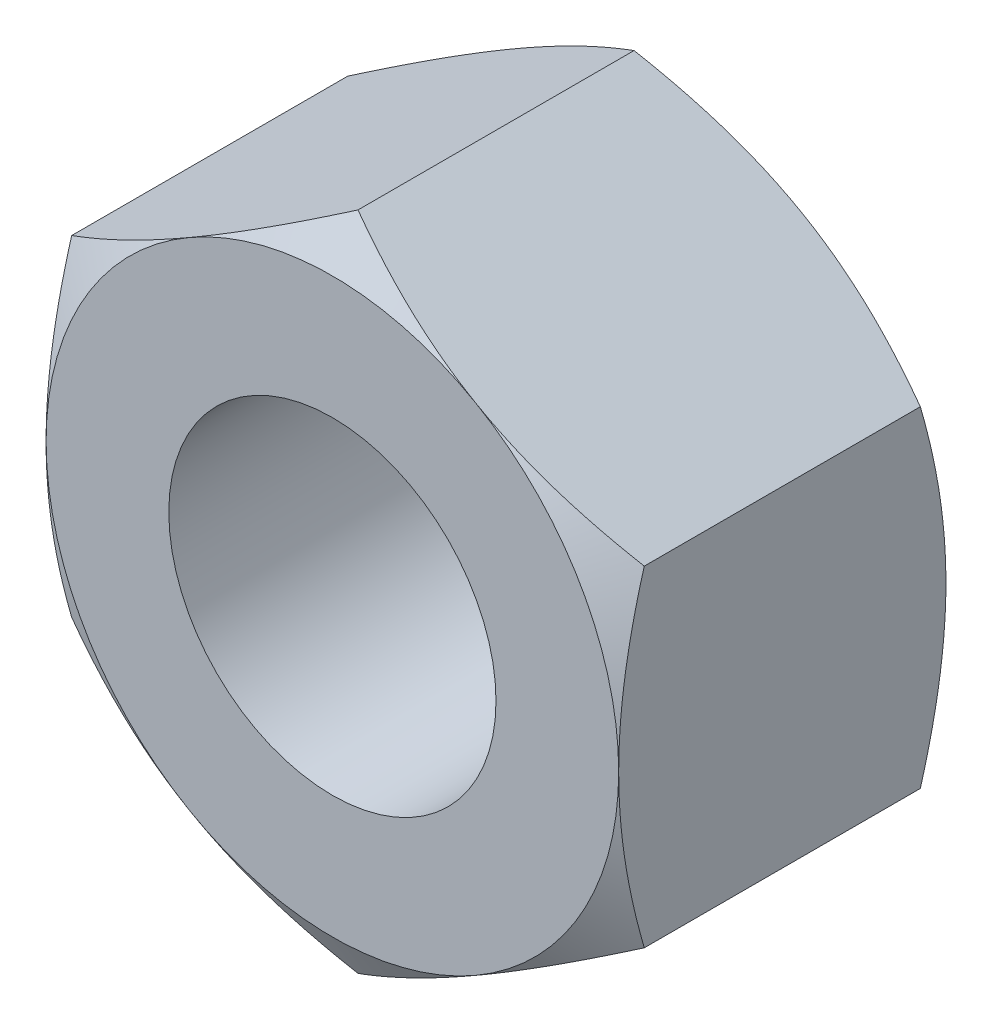
ISO-10303-21;
HEADER;
FILE_DESCRIPTION(('STEP AP214'),'2;1');
FILE_NAME('part.step','',(''),(''),'','','');
FILE_SCHEMA(('AUTOMOTIVE_DESIGN { 1 0 10303 214 1 1 1 1 }'));
ENDSEC;
DATA;
#1=APPLICATION_CONTEXT('core data for automotive mechanical design processes');
#2=APPLICATION_PROTOCOL_DEFINITION('international standard','automotive_design',2000,#1);
#3=PRODUCT_CONTEXT('',#1,'mechanical');
#4=PRODUCT('Part','Part','',(#3));
#5=PRODUCT_RELATED_PRODUCT_CATEGORY('part','',(#4));
#6=PRODUCT_DEFINITION_FORMATION('','',#4);
#7=PRODUCT_DEFINITION_CONTEXT('part definition',#1,'design');
#8=PRODUCT_DEFINITION('design','',#6,#7);
#9=PRODUCT_DEFINITION_SHAPE('','',#8);
#10=(LENGTH_UNIT() NAMED_UNIT(*) SI_UNIT(.MILLI.,.METRE.));
#11=(NAMED_UNIT(*) PLANE_ANGLE_UNIT() SI_UNIT($,.RADIAN.));
#12=(NAMED_UNIT(*) SI_UNIT($,.STERADIAN.) SOLID_ANGLE_UNIT());
#13=UNCERTAINTY_MEASURE_WITH_UNIT(LENGTH_MEASURE(1.E-05),#10,'distance_accuracy_value','');
#14=(GEOMETRIC_REPRESENTATION_CONTEXT(3) GLOBAL_UNCERTAINTY_ASSIGNED_CONTEXT((#13)) GLOBAL_UNIT_ASSIGNED_CONTEXT((#10,
#11,#12)) REPRESENTATION_CONTEXT('',''));
#15=CARTESIAN_POINT('',(0.,0.,0.));
#16=DIRECTION('',(0.,0.,1.));
#17=DIRECTION('',(1.,0.,0.));
#18=AXIS2_PLACEMENT_3D('',#15,#16,#17);
#19=CARTESIAN_POINT('',(0.,0.,4.));
#20=DIRECTION('',(0.,0.,1.));
#21=DIRECTION('',(1.,0.,0.));
#22=AXIS2_PLACEMENT_3D('',#19,#20,#21);
#23=PLANE('',#22);
#24=CARTESIAN_POINT('',(0.,0.,4.));
#25=DIRECTION('',(0.,0.,1.));
#26=DIRECTION('',(1.,0.,0.));
#27=AXIS2_PLACEMENT_3D('',#24,#25,#26);
#28=CIRCLE('',#27,3.49999999999999);
#29=CARTESIAN_POINT('',(3.5,0.,4.));
#30=VERTEX_POINT('',#29);
#31=CARTESIAN_POINT('',(1.75000000000001,-3.03108891324553,4.));
#32=VERTEX_POINT('',#31);
#33=EDGE_CURVE('E11',#30,#32,#28,.F.);
#34=ORIENTED_EDGE('',*,*,#33,.F.);
#35=CARTESIAN_POINT('',(1.75000000000001,3.03108891324553,4.));
#36=VERTEX_POINT('',#35);
#37=EDGE_CURVE('E38',#36,#30,#28,.F.);
#38=ORIENTED_EDGE('',*,*,#37,.F.);
#39=CARTESIAN_POINT('',(-1.74999999999999,3.03108891324554,4.));
#40=VERTEX_POINT('',#39);
#41=EDGE_CURVE('E277',#40,#36,#28,.F.);
#42=ORIENTED_EDGE('',*,*,#41,.F.);
#43=CARTESIAN_POINT('',(-3.5,0.,4.));
#44=VERTEX_POINT('',#43);
#45=EDGE_CURVE('E281',#44,#40,#28,.F.);
#46=ORIENTED_EDGE('',*,*,#45,.F.);
#47=CARTESIAN_POINT('',(-1.74999999999999,-3.03108891324554,4.));
#48=VERTEX_POINT('',#47);
#49=EDGE_CURVE('E305',#48,#44,#28,.F.);
#50=ORIENTED_EDGE('',*,*,#49,.F.);
#51=EDGE_CURVE('E43',#32,#48,#28,.F.);
#52=ORIENTED_EDGE('',*,*,#51,.F.);
#53=EDGE_LOOP('',(#34,#38,#42,#46,#50,#52));
#54=FACE_BOUND('',#53,.T.);
#55=CARTESIAN_POINT('',(0.,0.,4.));
#56=DIRECTION('',(0.,0.,1.));
#57=DIRECTION('',(1.,0.,0.));
#58=AXIS2_PLACEMENT_3D('',#55,#56,#57);
#59=CIRCLE('',#58,2.);
#60=CARTESIAN_POINT('',(2.,0.,4.));
#61=VERTEX_POINT('',#60);
#62=EDGE_CURVE('E248',#61,#61,#59,.T.);
#63=ORIENTED_EDGE('',*,*,#62,.F.);
#64=EDGE_LOOP('',(#63));
#65=FACE_BOUND('',#64,.T.);
#66=ADVANCED_FACE('F33',(#54,#65),#23,.T.);
#67=CARTESIAN_POINT('',(0.,0.,0.));
#68=DIRECTION('',(0.,0.,1.));
#69=DIRECTION('',(1.,0.,0.));
#70=AXIS2_PLACEMENT_3D('',#67,#68,#69);
#71=PLANE('',#70);
#72=CARTESIAN_POINT('',(0.,0.,0.));
#73=DIRECTION('',(0.,0.,1.));
#74=DIRECTION('',(1.,0.,0.));
#75=AXIS2_PLACEMENT_3D('',#72,#73,#74);
#76=CIRCLE('',#75,2.);
#77=CARTESIAN_POINT('',(2.,0.,0.));
#78=VERTEX_POINT('',#77);
#79=EDGE_CURVE('E251',#78,#78,#76,.F.);
#80=ORIENTED_EDGE('',*,*,#79,.F.);
#81=EDGE_LOOP('',(#80));
#82=FACE_BOUND('',#81,.T.);
#83=CARTESIAN_POINT('',(0.,0.,0.));
#84=DIRECTION('',(0.,0.,1.));
#85=DIRECTION('',(1.,0.,0.));
#86=AXIS2_PLACEMENT_3D('',#83,#84,#85);
#87=CIRCLE('',#86,3.49999999999999);
#88=CARTESIAN_POINT('',(1.75,3.03108891324553,0.));
#89=VERTEX_POINT('',#88);
#90=CARTESIAN_POINT('',(3.5,0.,0.));
#91=VERTEX_POINT('',#90);
#92=EDGE_CURVE('E142',#89,#91,#87,.F.);
#93=ORIENTED_EDGE('',*,*,#92,.T.);
#94=CARTESIAN_POINT('',(1.75,-3.03108891324553,0.));
#95=VERTEX_POINT('',#94);
#96=EDGE_CURVE('E150',#91,#95,#87,.F.);
#97=ORIENTED_EDGE('',*,*,#96,.T.);
#98=CARTESIAN_POINT('',(-1.75,-3.03108891324554,0.));
#99=VERTEX_POINT('',#98);
#100=EDGE_CURVE('E288',#95,#99,#87,.F.);
#101=ORIENTED_EDGE('',*,*,#100,.T.);
#102=CARTESIAN_POINT('',(-3.5,0.,0.));
#103=VERTEX_POINT('',#102);
#104=EDGE_CURVE('E291',#99,#103,#87,.F.);
#105=ORIENTED_EDGE('',*,*,#104,.T.);
#106=CARTESIAN_POINT('',(-1.75,3.03108891324554,0.));
#107=VERTEX_POINT('',#106);
#108=EDGE_CURVE('E154',#103,#107,#87,.F.);
#109=ORIENTED_EDGE('',*,*,#108,.T.);
#110=EDGE_CURVE('E128',#107,#89,#87,.F.);
#111=ORIENTED_EDGE('',*,*,#110,.T.);
#112=EDGE_LOOP('',(#93,#97,#101,#105,#109,#111));
#113=FACE_BOUND('',#112,.T.);
#114=ADVANCED_FACE('F151',(#82,#113),#71,.F.);
#115=CARTESIAN_POINT('',(0.,0.,-0.00100000000000013));
#116=DIRECTION('',(0.,0.,1.));
#117=DIRECTION('',(1.,0.,0.));
#118=AXIS2_PLACEMENT_3D('',#115,#116,#117);
#119=CYLINDRICAL_SURFACE('',#118,2.);
#120=ORIENTED_EDGE('',*,*,#62,.T.);
#121=EDGE_LOOP('',(#120));
#122=FACE_BOUND('',#121,.T.);
#123=ORIENTED_EDGE('',*,*,#79,.T.);
#124=EDGE_LOOP('',(#123));
#125=FACE_BOUND('',#124,.T.);
#126=ADVANCED_FACE('F333',(#122,#125),#119,.F.);
#127=CARTESIAN_POINT('',(0.,0.,1.99999999999999));
#128=DIRECTION('',(0.,0.,1.));
#129=DIRECTION('',(1.,0.,0.));
#130=AXIS2_PLACEMENT_3D('',#127,#128,#129);
#131=CONICAL_SURFACE('',#130,6.96410161513779,1.0471975511966);
#132=CARTESIAN_POINT('',(3.5,-5.45519430990487,1.72133877128074));
#133=CARTESIAN_POINT('',(3.5,-5.30207410531419,1.64695247526558));
#134=CARTESIAN_POINT('',(3.5,-5.14860527468032,1.5732716581178));
#135=CARTESIAN_POINT('',(3.5,-4.84078502728516,1.42771728825662));
#136=CARTESIAN_POINT('',(3.5,-4.68643347840116,1.35584401526786));
#137=CARTESIAN_POINT('',(3.5,-4.37588046871568,1.21394538752446));
#138=CARTESIAN_POINT('',(3.5,-4.21967352819375,1.1439319845114));
#139=CARTESIAN_POINT('',(3.5,-3.90602649209171,1.00673479979934));
#140=CARTESIAN_POINT('',(3.5,-3.74858645444087,0.939550886109097));
#141=CARTESIAN_POINT('',(3.5,-3.42708117765558,0.806633263191025));
#142=CARTESIAN_POINT('',(3.5,-3.26296687658298,0.741017585836152));
#143=CARTESIAN_POINT('',(3.5,-2.93282845135114,0.614686563150204));
#144=CARTESIAN_POINT('',(3.5,-2.76680411677797,0.553971763733598));
#145=CARTESIAN_POINT('',(3.5,-2.43288333087243,0.439016058702318));
#146=CARTESIAN_POINT('',(3.5,-2.2649913515245,0.38476229206775));
#147=CARTESIAN_POINT('',(3.5,-1.92679932486831,0.284451348590473));
#148=CARTESIAN_POINT('',(3.5,-1.75650004516851,0.238391619862058));
#149=CARTESIAN_POINT('',(3.5,-1.41432463666518,0.156901852467947));
#150=CARTESIAN_POINT('',(3.5,-1.24246240218227,0.121414538366513));
#151=CARTESIAN_POINT('',(3.5,-0.896572668283585,0.06306428383971));
#152=CARTESIAN_POINT('',(3.5,-0.722545390875949,0.0402000597498763));
#153=CARTESIAN_POINT('',(3.5,-0.375480083540643,0.00921812370481169));
#154=CARTESIAN_POINT('',(3.5,-0.20245960885449,0.000908605400914017));
#155=CARTESIAN_POINT('',(3.5,0.143670103831307,-0.000766076343882342));
#156=CARTESIAN_POINT('',(3.5,0.316779343751389,0.00586909847148927));
#157=CARTESIAN_POINT('',(3.5,0.609822561539331,0.0292790458924698));
#158=CARTESIAN_POINT('',(3.5,0.730066998486727,0.0423974842578047));
#159=CARTESIAN_POINT('',(3.5,0.969688542331738,0.0750434688864105));
#160=CARTESIAN_POINT('',(3.5,1.08906553264177,0.0945718609580701));
#161=CARTESIAN_POINT('',(3.5,1.44572590552468,0.161746861486087));
#162=CARTESIAN_POINT('',(3.5,1.68141230395974,0.217971844846831));
#163=CARTESIAN_POINT('',(3.5,2.03394340877959,0.315650082359494));
#164=CARTESIAN_POINT('',(3.5,2.15260940955841,0.350905657418922));
#165=CARTESIAN_POINT('',(3.5,2.3887886032686,0.42512091040231));
#166=CARTESIAN_POINT('',(3.5,2.5063017878082,0.464080615267938));
#167=CARTESIAN_POINT('',(3.5,2.74021290999465,0.545075266876938));
#168=CARTESIAN_POINT('',(3.5,2.85661118217145,0.587109256264606));
#169=CARTESIAN_POINT('',(3.5,3.08843931242516,0.673753617516125));
#170=CARTESIAN_POINT('',(3.5,3.20386918866012,0.718363940947816));
#171=CARTESIAN_POINT('',(3.5,3.50212684846259,0.836846816328761));
#172=CARTESIAN_POINT('',(3.5,3.68429688398129,0.912373157370813));
#173=CARTESIAN_POINT('',(3.5,4.04687596102653,1.0675544669986));
#174=CARTESIAN_POINT('',(3.5,4.22728483993995,1.14720981262281));
#175=CARTESIAN_POINT('',(3.5,4.586717894845,1.30971359246563));
#176=CARTESIAN_POINT('',(3.5,4.76574165040922,1.39256295377734));
#177=CARTESIAN_POINT('',(3.5,5.1226235548627,1.5607395401122));
#178=CARTESIAN_POINT('',(3.5,5.30048167200969,1.6460668322727));
#179=CARTESIAN_POINT('',(3.5,5.8331287111142,1.90519383502204));
#180=CARTESIAN_POINT('',(3.5,6.18649646052233,2.08191163241848));
#181=CARTESIAN_POINT('',(3.5,6.8905998674985,2.44032821615532));
#182=CARTESIAN_POINT('',(3.5,7.24133597495097,2.62202612522926));
#183=CARTESIAN_POINT('',(3.5,7.90653300532992,2.97079615200147));
#184=CARTESIAN_POINT('',(3.5,8.22116341317776,3.13754558570907));
#185=CARTESIAN_POINT('',(3.5,8.84934047800308,3.47310878648261));
#186=CARTESIAN_POINT('',(3.5,9.162887078266,3.64192265954216));
#187=CARTESIAN_POINT('',(3.5,9.78819651869821,3.98058089771805));
#188=CARTESIAN_POINT('',(3.5,10.0999618857039,4.15042060283278));
#189=CARTESIAN_POINT('',(3.5,10.7228127904779,4.49129148686705));
#190=CARTESIAN_POINT('',(3.5,11.0338983738492,4.66232258242458));
#191=CARTESIAN_POINT('',(3.5,11.3447416308959,4.8337899092484));
#192=B_SPLINE_CURVE_WITH_KNOTS('',3,(#132,#133,#134,#135,#136,#137,#138,#139,#140,#141,#142,
#143,#144,#145,#146,#147,#148,#149,#150,#151,#152,#153,#154,#155,#156,#157,#158,#159,#160,#161,
#162,#163,#164,#165,#166,#167,#168,#169,#170,#171,#172,#173,#174,#175,#176,#177,#178,#179,#180,
#181,#182,#183,#184,#185,#186,#187,#188,#189,#190,#191),.UNSPECIFIED.,.F.,.F.,(4,2,2,2,2,2,2,2,
2,2,2,2,2,2,2,2,2,2,2,2,2,2,2,2,2,2,2,2,2,4),(0.,0.51070373683401,1.02148602673776,
1.53500259956243,2.04849519105291,2.57867074927619,3.10890528310494,3.63806606190065,
4.16706175349099,4.69313723180645,5.21915920271268,5.73819541711383,6.25724337943225,
6.61994180397091,6.98268810666761,7.70855969207668,8.07990492899787,8.45125286707322,
8.82248565293817,9.19371146231784,9.78525513285665,10.3768529154637,10.9686237272046,
11.5604105874407,12.7456145372053,13.930611033641,14.9988604186191,16.0671648824704,
17.1322387611645,18.1972388502145),.UNSPECIFIED.);
#193=CARTESIAN_POINT('',(3.5,2.02072594216369,0.312607391169638));
#194=VERTEX_POINT('',#193);
#195=EDGE_CURVE('E145',#91,#194,#192,.T.);
#196=ORIENTED_EDGE('',*,*,#195,.F.);
#197=ORIENTED_EDGE('',*,*,#92,.F.);
#198=CARTESIAN_POINT('',(3.5002,2.02061047210985,0.312674060693366));
#199=CARTESIAN_POINT('',(3.34639282154755,2.10941108799267,0.261385788989979));
#200=CARTESIAN_POINT('',(3.19125798916558,2.19897822522909,0.214740953816194));
#201=CARTESIAN_POINT('',(2.87830199342322,2.37966345361545,0.133321875533347));
#202=CARTESIAN_POINT('',(2.7204752692125,2.47078475532382,0.0985764355845609));
#203=CARTESIAN_POINT('',(2.40677778961987,2.65189807961074,0.0444900271828373));
#204=CARTESIAN_POINT('',(2.25095530083931,2.74186223545399,0.0247890862603835));
#205=CARTESIAN_POINT('',(1.93857711279463,2.92221386641056,0.00127013273725678));
#206=CARTESIAN_POINT('',(1.78202254896577,3.01260068598001,-0.00256735545443255));
#207=CARTESIAN_POINT('',(1.48949078007901,3.1814939814933,0.00541530187698004));
#208=CARTESIAN_POINT('',(1.35346978754209,3.26002573814993,0.0152754340696098));
#209=CARTESIAN_POINT('',(1.08231397971101,3.41657761679354,0.0465264668994058));
#210=CARTESIAN_POINT('',(0.947180102315317,3.49459719728458,0.0679280432857999));
#211=CARTESIAN_POINT('',(0.675465207594816,3.65147186489429,0.121430407880578));
#212=CARTESIAN_POINT('',(0.538918580721665,3.73030709667644,0.153757994445088));
#213=CARTESIAN_POINT('',(0.267861907055499,3.88680174018324,0.227128933807995));
#214=CARTESIAN_POINT('',(0.133348387531464,3.96446315689009,0.268155046569867));
#215=CARTESIAN_POINT('',(-0.000199999999999596,4.04156735438122,0.31267406069337));
#216=B_SPLINE_CURVE_WITH_KNOTS('',3,(#198,#199,#200,#201,#202,#203,#204,#205,#206,#207,#208,
#209,#210,#211,#212,#213,#214,#215),.UNSPECIFIED.,.F.,.F.,(4,2,2,2,2,2,2,2,4),(0.,
0.554793832886253,1.11092123814984,1.65328467083219,2.19498204478403,2.6666513085086,
3.13875761298267,3.62133612600509,4.10296698719187),.UNSPECIFIED.);
#217=EDGE_CURVE('E138',#194,#89,#216,.T.);
#218=ORIENTED_EDGE('',*,*,#217,.F.);
#219=EDGE_LOOP('',(#196,#197,#218));
#220=FACE_BOUND('',#219,.T.);
#221=ADVANCED_FACE('F143',(#220),#131,.T.);
#222=CARTESIAN_POINT('',(0.,4.04145188432738,0.312607391169642));
#223=VERTEX_POINT('',#222);
#224=EDGE_CURVE('E124',#89,#223,#216,.T.);
#225=ORIENTED_EDGE('',*,*,#224,.F.);
#226=ORIENTED_EDGE('',*,*,#110,.F.);
#227=CARTESIAN_POINT('',(0.000200000000000381,4.04156735438122,0.31267406069337));
#228=CARTESIAN_POINT('',(-0.153607178452449,3.9527667384984,0.261385788989983));
#229=CARTESIAN_POINT('',(-0.308742010834423,3.86319960126198,0.214740953816198));
#230=CARTESIAN_POINT('',(-0.62169800657678,3.68251437287562,0.133321875533351));
#231=CARTESIAN_POINT('',(-0.779524730787495,3.59139307116725,0.0985764355845644));
#232=CARTESIAN_POINT('',(-1.09322221038013,3.41027974688034,0.0444900271828402));
#233=CARTESIAN_POINT('',(-1.24904469916069,3.32031559103708,0.0247890862603861));
#234=CARTESIAN_POINT('',(-1.56142288720537,3.13996396008052,0.00127013273725943));
#235=CARTESIAN_POINT('',(-1.71797745103423,3.04957714051106,-0.00256735545442963));
#236=CARTESIAN_POINT('',(-2.01050921992099,2.88068384499778,0.00541530187698267));
#237=CARTESIAN_POINT('',(-2.1465302124579,2.80215208834115,0.015275434069612));
#238=CARTESIAN_POINT('',(-2.41768602028899,2.64560020969754,0.0465264668994078));
#239=CARTESIAN_POINT('',(-2.55281989768468,2.5675806292065,0.067928043285802));
#240=CARTESIAN_POINT('',(-2.82453479240518,2.41070596159679,0.12143040788058));
#241=CARTESIAN_POINT('',(-2.96108141927834,2.33187072981464,0.15375799444509));
#242=CARTESIAN_POINT('',(-3.2321380929445,2.17537608630783,0.227128933807997));
#243=CARTESIAN_POINT('',(-3.36665161246854,2.09771466960099,0.268155046569869));
#244=CARTESIAN_POINT('',(-3.5002,2.02061047210985,0.312674060693373));
#245=B_SPLINE_CURVE_WITH_KNOTS('',3,(#227,#228,#229,#230,#231,#232,#233,#234,#235,#236,#237,
#238,#239,#240,#241,#242,#243,#244),.UNSPECIFIED.,.F.,.F.,(4,2,2,2,2,2,2,2,4),(0.,
0.554793832886252,1.11092123814983,1.65328467083218,2.19498204478403,2.6666513085086,
3.13875761298267,3.62133612600509,4.10296698719187),.UNSPECIFIED.);
#246=EDGE_CURVE('E131',#223,#107,#245,.T.);
#247=ORIENTED_EDGE('',*,*,#246,.F.);
#248=EDGE_LOOP('',(#225,#226,#247));
#249=FACE_BOUND('',#248,.T.);
#250=ADVANCED_FACE('F126',(#249),#131,.T.);
#251=CARTESIAN_POINT('',(-3.5,2.02072594216369,0.312607391169645));
#252=VERTEX_POINT('',#251);
#253=EDGE_CURVE('E204',#107,#252,#245,.T.);
#254=ORIENTED_EDGE('',*,*,#253,.F.);
#255=ORIENTED_EDGE('',*,*,#108,.F.);
#256=CARTESIAN_POINT('',(-3.5,-5.45519430990485,1.72133877128074));
#257=CARTESIAN_POINT('',(-3.5,-5.30207410531418,1.64695247526558));
#258=CARTESIAN_POINT('',(-3.5,-5.14860527468031,1.5732716581178));
#259=CARTESIAN_POINT('',(-3.5,-4.84078502728515,1.42771728825662));
#260=CARTESIAN_POINT('',(-3.5,-4.68643347840115,1.35584401526786));
#261=CARTESIAN_POINT('',(-3.5,-4.37588046871567,1.21394538752447));
#262=CARTESIAN_POINT('',(-3.5,-4.21967352819374,1.14393198451141));
#263=CARTESIAN_POINT('',(-3.5,-3.9060264920917,1.00673479979934));
#264=CARTESIAN_POINT('',(-3.5,-3.74858645444087,0.939550886109103));
#265=CARTESIAN_POINT('',(-3.5,-3.42708117765557,0.806633263191031));
#266=CARTESIAN_POINT('',(-3.5,-3.26296687658297,0.741017585836158));
#267=CARTESIAN_POINT('',(-3.5,-2.93282845135114,0.61468656315021));
#268=CARTESIAN_POINT('',(-3.5,-2.76680411677796,0.553971763733604));
#269=CARTESIAN_POINT('',(-3.5,-2.43288333087243,0.439016058702324));
#270=CARTESIAN_POINT('',(-3.5,-2.2649913515245,0.384762292067755));
#271=CARTESIAN_POINT('',(-3.5,-1.92679932486831,0.284451348590478));
#272=CARTESIAN_POINT('',(-3.5,-1.7565000451685,0.238391619862064));
#273=CARTESIAN_POINT('',(-3.5,-1.41432463666518,0.156901852467953));
#274=CARTESIAN_POINT('',(-3.5,-1.24246240218227,0.121414538366519));
#275=CARTESIAN_POINT('',(-3.5,-0.896572668283585,0.0630642838397154));
#276=CARTESIAN_POINT('',(-3.5,-0.722545390875949,0.0402000597498815));
#277=CARTESIAN_POINT('',(-3.5,-0.375480083540644,0.00921812370481673));
#278=CARTESIAN_POINT('',(-3.5,-0.202459608854491,0.000908605400919081));
#279=CARTESIAN_POINT('',(-3.5,0.143670103831305,-0.000766076343877335));
#280=CARTESIAN_POINT('',(-3.5,0.316779343751386,0.00586909847149419));
#281=CARTESIAN_POINT('',(-3.5,0.609822561539328,0.0292790458924746));
#282=CARTESIAN_POINT('',(-3.5,0.730066998486723,0.0423974842578094));
#283=CARTESIAN_POINT('',(-3.5,0.969688542331733,0.0750434688864149));
#284=CARTESIAN_POINT('',(-3.5,1.08906553264177,0.0945718609580743));
#285=CARTESIAN_POINT('',(-3.5,1.44572590552467,0.161746861486091));
#286=CARTESIAN_POINT('',(-3.5,1.68141230395973,0.217971844846835));
#287=CARTESIAN_POINT('',(-3.5,2.03394340877957,0.315650082359497));
#288=CARTESIAN_POINT('',(-3.5,2.1526094095584,0.350905657418925));
#289=CARTESIAN_POINT('',(-3.5,2.38878860326859,0.425120910402313));
#290=CARTESIAN_POINT('',(-3.5,2.50630178780818,0.46408061526794));
#291=CARTESIAN_POINT('',(-3.5,2.74021290999463,0.54507526687694));
#292=CARTESIAN_POINT('',(-3.5,2.85661118217144,0.587109256264607));
#293=CARTESIAN_POINT('',(-3.5,3.08843931242514,0.673753617516126));
#294=CARTESIAN_POINT('',(-3.5,3.2038691886601,0.718363940947817));
#295=CARTESIAN_POINT('',(-3.5,3.50212684846257,0.836846816328762));
#296=CARTESIAN_POINT('',(-3.5,3.68429688398127,0.912373157370814));
#297=CARTESIAN_POINT('',(-3.5,4.04687596102651,1.0675544669986));
#298=CARTESIAN_POINT('',(-3.5,4.22728483993993,1.14720981262281));
#299=CARTESIAN_POINT('',(-3.5,4.58671789484498,1.30971359246563));
#300=CARTESIAN_POINT('',(-3.5,4.7657416504092,1.39256295377734));
#301=CARTESIAN_POINT('',(-3.5,5.12262355486268,1.5607395401122));
#302=CARTESIAN_POINT('',(-3.5,5.30048167200967,1.6460668322727));
#303=CARTESIAN_POINT('',(-3.5,5.83312871111418,1.90519383502205));
#304=CARTESIAN_POINT('',(-3.5,6.18649646052231,2.08191163241848));
#305=CARTESIAN_POINT('',(-3.5,6.89059986749848,2.44032821615532));
#306=CARTESIAN_POINT('',(-3.5,7.24133597495096,2.62202612522926));
#307=CARTESIAN_POINT('',(-3.5,7.9065330053299,2.97079615200147));
#308=CARTESIAN_POINT('',(-3.5,8.22116341317775,3.13754558570908));
#309=CARTESIAN_POINT('',(-3.5,8.84934047800306,3.47310878648262));
#310=CARTESIAN_POINT('',(-3.5,9.16288707826598,3.64192265954217));
#311=CARTESIAN_POINT('',(-3.5,9.78819651869819,3.98058089771805));
#312=CARTESIAN_POINT('',(-3.5,10.0999618857039,4.15042060283278));
#313=CARTESIAN_POINT('',(-3.5,10.7228127904779,4.49129148686705));
#314=CARTESIAN_POINT('',(-3.5,11.0338983738491,4.66232258242458));
#315=CARTESIAN_POINT('',(-3.5,11.3447416308959,4.8337899092484));
#316=B_SPLINE_CURVE_WITH_KNOTS('',3,(#256,#257,#258,#259,#260,#261,#262,#263,#264,#265,#266,
#267,#268,#269,#270,#271,#272,#273,#274,#275,#276,#277,#278,#279,#280,#281,#282,#283,#284,#285,
#286,#287,#288,#289,#290,#291,#292,#293,#294,#295,#296,#297,#298,#299,#300,#301,#302,#303,#304,
#305,#306,#307,#308,#309,#310,#311,#312,#313,#314,#315),.UNSPECIFIED.,.F.,.F.,(4,2,2,2,2,2,2,2,
2,2,2,2,2,2,2,2,2,2,2,2,2,2,2,2,2,2,2,2,2,4),(0.,0.510703736834008,1.02148602673775,
1.53500259956242,2.0484951910529,2.57867074927618,3.10890528310493,3.63806606190064,
4.16706175349098,4.69313723180643,5.21915920271267,5.73819541711382,6.25724337943223,
6.61994180397089,6.98268810666759,7.70855969207665,8.07990492899784,8.45125286707319,
8.82248565293814,9.1937114623178,9.78525513285662,10.3768529154637,10.9686237272046,
11.5604105874406,12.7456145372052,13.930611033641,14.9988604186191,16.0671648824704,
17.1322387611644,18.1972388502144),.UNSPECIFIED.);
#317=EDGE_CURVE('E197',#252,#103,#316,.F.);
#318=ORIENTED_EDGE('',*,*,#317,.F.);
#319=EDGE_LOOP('',(#254,#255,#318));
#320=FACE_BOUND('',#319,.T.);
#321=ADVANCED_FACE('F300',(#320),#131,.T.);
#322=CARTESIAN_POINT('',(-3.5,-2.02072594216407,0.312607391169393));
#323=VERTEX_POINT('',#322);
#324=EDGE_CURVE('E203',#103,#323,#316,.F.);
#325=ORIENTED_EDGE('',*,*,#324,.F.);
#326=ORIENTED_EDGE('',*,*,#104,.F.);
#327=CARTESIAN_POINT('',(-3.5002,-2.02061047210985,0.312674060693372));
#328=CARTESIAN_POINT('',(-3.34639282154755,-2.10941108799267,0.261385788989985));
#329=CARTESIAN_POINT('',(-3.19125798916558,-2.19897822522909,0.2147409538162));
#330=CARTESIAN_POINT('',(-2.87830199342322,-2.37966345361545,0.133321875533352));
#331=CARTESIAN_POINT('',(-2.72047526921251,-2.47078475532382,0.0985764355845655));
#332=CARTESIAN_POINT('',(-2.40677778961988,-2.65189807961073,0.0444900271828406));
#333=CARTESIAN_POINT('',(-2.25095530083931,-2.74186223545399,0.0247890862603861));
#334=CARTESIAN_POINT('',(-1.93857711279463,-2.92221386641055,0.0012701327372587));
#335=CARTESIAN_POINT('',(-1.78202254896578,-3.01260068598001,-0.00256735545443074));
#336=CARTESIAN_POINT('',(-1.48949078007902,-3.18149398149329,0.00541530187698111));
#337=CARTESIAN_POINT('',(-1.3534697875421,-3.26002573814992,0.0152754340696103));
#338=CARTESIAN_POINT('',(-1.08231397971101,-3.41657761679353,0.0465264668994058));
#339=CARTESIAN_POINT('',(-0.947180102315321,-3.49459719728457,0.0679280432857997));
#340=CARTESIAN_POINT('',(-0.67546520759482,-3.65147186489428,0.121430407880578));
#341=CARTESIAN_POINT('',(-0.538918580721667,-3.73030709667643,0.153757994445087));
#342=CARTESIAN_POINT('',(-0.2678619070555,-3.88680174018324,0.227128933807994));
#343=CARTESIAN_POINT('',(-0.133348387531465,-3.96446315689009,0.268155046569866));
#344=CARTESIAN_POINT('',(0.000199999999999129,-4.04156735438122,0.312674060693369));
#345=B_SPLINE_CURVE_WITH_KNOTS('',3,(#327,#328,#329,#330,#331,#332,#333,#334,#335,#336,#337,
#338,#339,#340,#341,#342,#343,#344),.UNSPECIFIED.,.F.,.F.,(4,2,2,2,2,2,2,2,4),(0.,
0.554793832886252,1.11092123814983,1.65328467083218,2.19498204478402,2.66665130850859,
3.13875761298267,3.62133612600509,4.10296698719187),.UNSPECIFIED.);
#346=EDGE_CURVE('E205',#323,#99,#345,.T.);
#347=ORIENTED_EDGE('',*,*,#346,.F.);
#348=EDGE_LOOP('',(#325,#326,#347));
#349=FACE_BOUND('',#348,.T.);
#350=ADVANCED_FACE('F182',(#349),#131,.T.);
#351=CARTESIAN_POINT('',(0.,-4.04145188432738,0.312607391169641));
#352=VERTEX_POINT('',#351);
#353=EDGE_CURVE('E353',#99,#352,#345,.T.);
#354=ORIENTED_EDGE('',*,*,#353,.F.);
#355=ORIENTED_EDGE('',*,*,#100,.F.);
#356=CARTESIAN_POINT('',(-0.000200000000001019,-4.04156735438122,0.312674060693369));
#357=CARTESIAN_POINT('',(0.153607178452448,-3.9527667384984,0.261385788989982));
#358=CARTESIAN_POINT('',(0.308742010834423,-3.86319960126198,0.214740953816196));
#359=CARTESIAN_POINT('',(0.621698006576779,-3.68251437287562,0.133321875533349));
#360=CARTESIAN_POINT('',(0.779524730787494,-3.59139307116725,0.0985764355845624));
#361=CARTESIAN_POINT('',(1.09322221038012,-3.41027974688034,0.0444900271828378));
#362=CARTESIAN_POINT('',(1.24904469916069,-3.32031559103708,0.0247890862603835));
#363=CARTESIAN_POINT('',(1.56142288720537,-3.13996396008052,0.00127013273725603));
#364=CARTESIAN_POINT('',(1.71797745103423,-3.04957714051106,-0.00256735545443351));
#365=CARTESIAN_POINT('',(2.01050921992099,-2.88068384499778,0.00541530187697872));
#366=CARTESIAN_POINT('',(2.1465302124579,-2.80215208834115,0.0152754340696083));
#367=CARTESIAN_POINT('',(2.41768602028899,-2.64560020969754,0.046526466899404));
#368=CARTESIAN_POINT('',(2.55281989768468,-2.5675806292065,0.0679280432857976));
#369=CARTESIAN_POINT('',(2.82453479240518,-2.41070596159679,0.121430407880575));
#370=CARTESIAN_POINT('',(2.96108141927833,-2.33187072981464,0.153757994445085));
#371=CARTESIAN_POINT('',(3.2321380929445,-2.17537608630783,0.227128933807991));
#372=CARTESIAN_POINT('',(3.36665161246854,-2.09771466960099,0.268155046569863));
#373=CARTESIAN_POINT('',(3.5002,-2.02061047210985,0.312674060693366));
#374=B_SPLINE_CURVE_WITH_KNOTS('',3,(#356,#357,#358,#359,#360,#361,#362,#363,#364,#365,#366,
#367,#368,#369,#370,#371,#372,#373),.UNSPECIFIED.,.F.,.F.,(4,2,2,2,2,2,2,2,4),(0.,
0.554793832886252,1.11092123814983,1.65328467083218,2.19498204478403,2.6666513085086,
3.13875761298267,3.62133612600509,4.10296698719187),.UNSPECIFIED.);
#375=EDGE_CURVE('E163',#352,#95,#374,.T.);
#376=ORIENTED_EDGE('',*,*,#375,.F.);
#377=EDGE_LOOP('',(#354,#355,#376));
#378=FACE_BOUND('',#377,.T.);
#379=ADVANCED_FACE('F177',(#378),#131,.T.);
#380=CARTESIAN_POINT('',(3.5,-2.02072594216369,0.312607391169638));
#381=VERTEX_POINT('',#380);
#382=EDGE_CURVE('E159',#95,#381,#374,.T.);
#383=ORIENTED_EDGE('',*,*,#382,.F.);
#384=ORIENTED_EDGE('',*,*,#96,.F.);
#385=EDGE_CURVE('E136',#381,#91,#192,.T.);
#386=ORIENTED_EDGE('',*,*,#385,.F.);
#387=EDGE_LOOP('',(#383,#384,#386));
#388=FACE_BOUND('',#387,.T.);
#389=ADVANCED_FACE('F181',(#388),#131,.T.);
#390=CARTESIAN_POINT('',(0.,0.,5.));
#391=DIRECTION('',(0.,0.,-1.));
#392=DIRECTION('',(-1.,0.,0.));
#393=AXIS2_PLACEMENT_3D('',#390,#391,#392);
#394=CONICAL_SURFACE('',#393,1.7679491924311,1.0471975511966);
#395=CARTESIAN_POINT('',(-0.000199999999999687,4.04156735438122,3.68732593930663));
#396=CARTESIAN_POINT('',(0.15360717845245,3.9527667384984,3.73861421101001));
#397=CARTESIAN_POINT('',(0.308742010834424,3.86319960126198,3.7852590461838));
#398=CARTESIAN_POINT('',(0.621698006576782,3.68251437287562,3.86667812446665));
#399=CARTESIAN_POINT('',(0.779524730787496,3.59139307116725,3.90142356441543));
#400=CARTESIAN_POINT('',(1.09322221038013,3.41027974688034,3.95550997281716));
#401=CARTESIAN_POINT('',(1.24904469916069,3.32031559103708,3.97521091373961));
#402=CARTESIAN_POINT('',(1.56142288720537,3.13996396008052,3.99872986726274));
#403=CARTESIAN_POINT('',(1.71797745103423,3.04957714051106,4.00256735545443));
#404=CARTESIAN_POINT('',(2.01050921992099,2.88068384499777,3.99458469812301));
#405=CARTESIAN_POINT('',(2.14653021245791,2.80215208834114,3.98472456593038));
#406=CARTESIAN_POINT('',(2.417686020289,2.64560020969754,3.95347353310059));
#407=CARTESIAN_POINT('',(2.55281989768468,2.5675806292065,3.93207195671419));
#408=CARTESIAN_POINT('',(2.82453479240518,2.41070596159678,3.87856959211941));
#409=CARTESIAN_POINT('',(2.96108141927834,2.33187072981464,3.8462420055549));
#410=CARTESIAN_POINT('',(3.2321380929445,2.17537608630783,3.772871066192));
#411=CARTESIAN_POINT('',(3.36665161246854,2.09771466960098,3.73184495343012));
#412=CARTESIAN_POINT('',(3.5002,2.02061047210985,3.68732593930662));
#413=B_SPLINE_CURVE_WITH_KNOTS('',3,(#395,#396,#397,#398,#399,#400,#401,#402,#403,#404,#405,
#406,#407,#408,#409,#410,#411,#412),.UNSPECIFIED.,.F.,.F.,(4,2,2,2,2,2,2,2,4),(0.,
0.554793832886253,1.11092123814984,1.65328467083219,2.19498204478403,2.6666513085086,
3.13875761298267,3.6213361260051,4.10296698719187),.UNSPECIFIED.);
#414=CARTESIAN_POINT('',(3.5,2.02072594216369,3.68739260883035));
#415=VERTEX_POINT('',#414);
#416=EDGE_CURVE('E247',#36,#415,#413,.T.);
#417=ORIENTED_EDGE('',*,*,#416,.F.);
#418=ORIENTED_EDGE('',*,*,#37,.T.);
#419=CARTESIAN_POINT('',(3.5,-5.45519430990486,2.27866122871924));
#420=CARTESIAN_POINT('',(3.5,-5.30207410531418,2.35304752473439));
#421=CARTESIAN_POINT('',(3.5,-5.14860527468032,2.42672834188218));
#422=CARTESIAN_POINT('',(3.5,-4.84078502728515,2.57228271174336));
#423=CARTESIAN_POINT('',(3.5,-4.68643347840115,2.64415598473212));
#424=CARTESIAN_POINT('',(3.5,-4.37588046871568,2.78605461247552));
#425=CARTESIAN_POINT('',(3.5,-4.21967352819375,2.85606801548857));
#426=CARTESIAN_POINT('',(3.5,-3.90602649209171,2.99326520020064));
#427=CARTESIAN_POINT('',(3.5,-3.74858645444087,3.06044911389088));
#428=CARTESIAN_POINT('',(3.5,-3.42708117765558,3.19336673680896));
#429=CARTESIAN_POINT('',(3.5,-3.26296687658297,3.25898241416383));
#430=CARTESIAN_POINT('',(3.5,-2.93282845135114,3.38531343684978));
#431=CARTESIAN_POINT('',(3.5,-2.76680411677797,3.44602823626639));
#432=CARTESIAN_POINT('',(3.5,-2.43288333087243,3.56098394129767));
#433=CARTESIAN_POINT('',(3.5,-2.2649913515245,3.61523770793224));
#434=CARTESIAN_POINT('',(3.5,-1.92679932486831,3.71554865140951));
#435=CARTESIAN_POINT('',(3.5,-1.75650004516851,3.76160838013793));
#436=CARTESIAN_POINT('',(3.5,-1.41432463666518,3.84309814753204));
#437=CARTESIAN_POINT('',(3.5,-1.24246240218227,3.87858546163348));
#438=CARTESIAN_POINT('',(3.5,-0.896572668283583,3.93693571616028));
#439=CARTESIAN_POINT('',(3.5,-0.722545390875947,3.95979994025011));
#440=CARTESIAN_POINT('',(3.5,-0.375480083540642,3.99078187629518));
#441=CARTESIAN_POINT('',(3.5,-0.202459608854488,3.99909139459908));
#442=CARTESIAN_POINT('',(3.5,0.143670103831309,4.00076607634387));
#443=CARTESIAN_POINT('',(3.5,0.316779343751391,3.9941309015285));
#444=CARTESIAN_POINT('',(3.5,0.609822561539332,3.97072095410752));
#445=CARTESIAN_POINT('',(3.5,0.730066998486726,3.95760251574219));
#446=CARTESIAN_POINT('',(3.5,0.969688542331733,3.92495653111358));
#447=CARTESIAN_POINT('',(3.5,1.08906553264177,3.90542813904192));
#448=CARTESIAN_POINT('',(3.5,1.44572590552467,3.8382531385139));
#449=CARTESIAN_POINT('',(3.5,1.68141230395972,3.78202815515316));
#450=CARTESIAN_POINT('',(3.5,2.03394340877957,3.6843499176405));
#451=CARTESIAN_POINT('',(3.5,2.15260940955839,3.64909434258107));
#452=CARTESIAN_POINT('',(3.5,2.38878860326858,3.57487908959768));
#453=CARTESIAN_POINT('',(3.5,2.50630178780817,3.53591938473206));
#454=CARTESIAN_POINT('',(3.5,2.74021290999462,3.45492473312306));
#455=CARTESIAN_POINT('',(3.5,2.85661118217142,3.41289074373539));
#456=CARTESIAN_POINT('',(3.5,3.08843931242512,3.32624638248387));
#457=CARTESIAN_POINT('',(3.5,3.20386918866008,3.28163605905218));
#458=CARTESIAN_POINT('',(3.5,3.50212684846255,3.16315318367123));
#459=CARTESIAN_POINT('',(3.5,3.68429688398125,3.08762684262918));
#460=CARTESIAN_POINT('',(3.5,4.04687596102649,2.9324455330014));
#461=CARTESIAN_POINT('',(3.5,4.22728483993991,2.85279018737719));
#462=CARTESIAN_POINT('',(3.5,4.58671789484497,2.69028640753436));
#463=CARTESIAN_POINT('',(3.5,4.76574165040919,2.60743704622265));
#464=CARTESIAN_POINT('',(3.5,5.12262355486267,2.43926045988779));
#465=CARTESIAN_POINT('',(3.5,5.30048167200965,2.35393316772729));
#466=CARTESIAN_POINT('',(3.5,5.83312871111417,2.09480616497794));
#467=CARTESIAN_POINT('',(3.5,6.18649646052229,1.9180883675815));
#468=CARTESIAN_POINT('',(3.5,6.89059986749847,1.55967178384466));
#469=CARTESIAN_POINT('',(3.5,7.24133597495094,1.37797387477072));
#470=CARTESIAN_POINT('',(3.5,7.90653300532988,1.02920384799851));
#471=CARTESIAN_POINT('',(3.5,8.22116341317773,0.862454414290903));
#472=CARTESIAN_POINT('',(3.5,8.84934047800304,0.52689121351736));
#473=CARTESIAN_POINT('',(3.5,9.16288707826596,0.358077340457811));
#474=CARTESIAN_POINT('',(3.5,9.78819651869816,0.019419102281925));
#475=CARTESIAN_POINT('',(3.5,10.0999618857038,-0.150420602832808));
#476=CARTESIAN_POINT('',(3.5,10.7228127904778,-0.491291486867077));
#477=CARTESIAN_POINT('',(3.5,11.0338983738491,-0.662322582424612));
#478=CARTESIAN_POINT('',(3.5,11.3447416308958,-0.833789909248428));
#479=B_SPLINE_CURVE_WITH_KNOTS('',3,(#419,#420,#421,#422,#423,#424,#425,#426,#427,#428,#429,
#430,#431,#432,#433,#434,#435,#436,#437,#438,#439,#440,#441,#442,#443,#444,#445,#446,#447,#448,
#449,#450,#451,#452,#453,#454,#455,#456,#457,#458,#459,#460,#461,#462,#463,#464,#465,#466,#467,
#468,#469,#470,#471,#472,#473,#474,#475,#476,#477,#478),.UNSPECIFIED.,.F.,.F.,(4,2,2,2,2,2,2,2,
2,2,2,2,2,2,2,2,2,2,2,2,2,2,2,2,2,2,2,2,2,4),(0.,0.510703736834009,1.02148602673776,
1.53500259956243,2.04849519105291,2.57867074927619,3.10890528310493,3.63806606190064,
4.16706175349099,4.69313723180644,5.21915920271268,5.73819541711383,6.25724337943225,
6.6199418039709,6.9826881066676,7.70855969207666,8.07990492899784,8.45125286707319,
8.82248565293814,9.1937114623178,9.78525513285661,10.3768529154637,10.9686237272046,
11.5604105874406,12.7456145372052,13.930611033641,14.9988604186191,16.0671648824704,
17.1322387611644,18.1972388502144),.UNSPECIFIED.);
#480=EDGE_CURVE('E252',#415,#30,#479,.F.);
#481=ORIENTED_EDGE('',*,*,#480,.F.);
#482=EDGE_LOOP('',(#417,#418,#481));
#483=FACE_BOUND('',#482,.T.);
#484=ADVANCED_FACE('F184',(#483),#394,.T.);
#485=CARTESIAN_POINT('',(-3.5002,2.02061047210985,3.68732593930663));
#486=CARTESIAN_POINT('',(-3.34639282154755,2.10941108799267,3.73861421101002));
#487=CARTESIAN_POINT('',(-3.19125798916558,2.19897822522909,3.7852590461838));
#488=CARTESIAN_POINT('',(-2.87830199342322,2.37966345361545,3.86667812446665));
#489=CARTESIAN_POINT('',(-2.7204752692125,2.47078475532382,3.90142356441544));
#490=CARTESIAN_POINT('',(-2.40677778961987,2.65189807961074,3.95550997281716));
#491=CARTESIAN_POINT('',(-2.25095530083931,2.74186223545399,3.97521091373962));
#492=CARTESIAN_POINT('',(-1.93857711279463,2.92221386641056,3.99872986726274));
#493=CARTESIAN_POINT('',(-1.78202254896577,3.01260068598001,4.00256735545443));
#494=CARTESIAN_POINT('',(-1.48949078007901,3.1814939814933,3.99458469812302));
#495=CARTESIAN_POINT('',(-1.35346978754209,3.26002573814993,3.98472456593039));
#496=CARTESIAN_POINT('',(-1.08231397971101,3.41657761679354,3.95347353310059));
#497=CARTESIAN_POINT('',(-0.947180102315317,3.49459719728458,3.9320719567142));
#498=CARTESIAN_POINT('',(-0.675465207594816,3.65147186489429,3.87856959211942));
#499=CARTESIAN_POINT('',(-0.538918580721665,3.73030709667644,3.84624200555491));
#500=CARTESIAN_POINT('',(-0.267861907055498,3.88680174018324,3.772871066192));
#501=CARTESIAN_POINT('',(-0.133348387531463,3.96446315689009,3.73184495343013));
#502=CARTESIAN_POINT('',(0.00020000000000026,4.04156735438122,3.68732593930663));
#503=B_SPLINE_CURVE_WITH_KNOTS('',3,(#485,#486,#487,#488,#489,#490,#491,#492,#493,#494,#495,
#496,#497,#498,#499,#500,#501,#502),.UNSPECIFIED.,.F.,.F.,(4,2,2,2,2,2,2,2,4),(0.,
0.554793832886254,1.11092123814984,1.65328467083219,2.19498204478403,2.6666513085086,
3.13875761298267,3.62133612600509,4.10296698719187),.UNSPECIFIED.);
#504=CARTESIAN_POINT('',(0.,4.04145188432738,3.68739260883035));
#505=VERTEX_POINT('',#504);
#506=EDGE_CURVE('E240',#40,#505,#503,.T.);
#507=ORIENTED_EDGE('',*,*,#506,.F.);
#508=ORIENTED_EDGE('',*,*,#41,.T.);
#509=EDGE_CURVE('E241',#505,#36,#413,.T.);
#510=ORIENTED_EDGE('',*,*,#509,.F.);
#511=EDGE_LOOP('',(#507,#508,#510));
#512=FACE_BOUND('',#511,.T.);
#513=ADVANCED_FACE('F274',(#512),#394,.T.);
#514=CARTESIAN_POINT('',(-3.5,-5.45519430990486,2.27866122871925));
#515=CARTESIAN_POINT('',(-3.5,-5.30207410531419,2.35304752473441));
#516=CARTESIAN_POINT('',(-3.5,-5.14860527468032,2.42672834188219));
#517=CARTESIAN_POINT('',(-3.5,-4.84078502728516,2.57228271174337));
#518=CARTESIAN_POINT('',(-3.5,-4.68643347840115,2.64415598473213));
#519=CARTESIAN_POINT('',(-3.5,-4.37588046871568,2.78605461247553));
#520=CARTESIAN_POINT('',(-3.5,-4.21967352819375,2.85606801548859));
#521=CARTESIAN_POINT('',(-3.5,-3.90602649209171,2.99326520020065));
#522=CARTESIAN_POINT('',(-3.5,-3.74858645444087,3.0604491138909));
#523=CARTESIAN_POINT('',(-3.5,-3.42708117765558,3.19336673680897));
#524=CARTESIAN_POINT('',(-3.5,-3.26296687658297,3.25898241416384));
#525=CARTESIAN_POINT('',(-3.5,-2.93282845135114,3.38531343684979));
#526=CARTESIAN_POINT('',(-3.5,-2.76680411677797,3.4460282362664));
#527=CARTESIAN_POINT('',(-3.5,-2.43288333087243,3.56098394129768));
#528=CARTESIAN_POINT('',(-3.5,-2.2649913515245,3.61523770793225));
#529=CARTESIAN_POINT('',(-3.5,-1.92679932486831,3.71554865140953));
#530=CARTESIAN_POINT('',(-3.5,-1.75650004516851,3.76160838013794));
#531=CARTESIAN_POINT('',(-3.5,-1.41432463666518,3.84309814753205));
#532=CARTESIAN_POINT('',(-3.5,-1.24246240218227,3.87858546163349));
#533=CARTESIAN_POINT('',(-3.5,-0.896572668283584,3.93693571616029));
#534=CARTESIAN_POINT('',(-3.5,-0.722545390875948,3.95979994025013));
#535=CARTESIAN_POINT('',(-3.5,-0.375480083540642,3.99078187629519));
#536=CARTESIAN_POINT('',(-3.5,-0.202459608854489,3.99909139459909));
#537=CARTESIAN_POINT('',(-3.5,0.143670103831308,4.00076607634388));
#538=CARTESIAN_POINT('',(-3.5,0.316779343751391,3.99413090152851));
#539=CARTESIAN_POINT('',(-3.5,0.609822561539332,3.97072095410753));
#540=CARTESIAN_POINT('',(-3.5,0.730066998486726,3.9576025157422));
#541=CARTESIAN_POINT('',(-3.5,0.969688542331734,3.92495653111359));
#542=CARTESIAN_POINT('',(-3.5,1.08906553264177,3.90542813904193));
#543=CARTESIAN_POINT('',(-3.5,1.44572590552467,3.83825313851391));
#544=CARTESIAN_POINT('',(-3.5,1.68141230395973,3.78202815515317));
#545=CARTESIAN_POINT('',(-3.5,2.03394340877957,3.68434991764051));
#546=CARTESIAN_POINT('',(-3.5,2.1526094095584,3.64909434258108));
#547=CARTESIAN_POINT('',(-3.5,2.38878860326858,3.57487908959769));
#548=CARTESIAN_POINT('',(-3.5,2.50630178780817,3.53591938473207));
#549=CARTESIAN_POINT('',(-3.5,2.74021290999463,3.45492473312307));
#550=CARTESIAN_POINT('',(-3.5,2.85661118217143,3.4128907437354));
#551=CARTESIAN_POINT('',(-3.5,3.08843931242513,3.32624638248388));
#552=CARTESIAN_POINT('',(-3.5,3.20386918866009,3.28163605905219));
#553=CARTESIAN_POINT('',(-3.5,3.50212684846256,3.16315318367125));
#554=CARTESIAN_POINT('',(-3.5,3.68429688398126,3.08762684262919));
#555=CARTESIAN_POINT('',(-3.5,4.0468759610265,2.93244553300141));
#556=CARTESIAN_POINT('',(-3.5,4.22728483993992,2.8527901873772));
#557=CARTESIAN_POINT('',(-3.5,4.58671789484498,2.69028640753437));
#558=CARTESIAN_POINT('',(-3.5,4.7657416504092,2.60743704622266));
#559=CARTESIAN_POINT('',(-3.5,5.12262355486267,2.4392604598878));
#560=CARTESIAN_POINT('',(-3.5,5.30048167200966,2.3539331677273));
#561=CARTESIAN_POINT('',(-3.5,5.83312871111417,2.09480616497795));
#562=CARTESIAN_POINT('',(-3.5,6.1864964605223,1.91808836758151));
#563=CARTESIAN_POINT('',(-3.5,6.89059986749847,1.55967178384467));
#564=CARTESIAN_POINT('',(-3.5,7.24133597495095,1.37797387477073));
#565=CARTESIAN_POINT('',(-3.5,7.90653300532989,1.02920384799852));
#566=CARTESIAN_POINT('',(-3.5,8.22116341317773,0.862454414290916));
#567=CARTESIAN_POINT('',(-3.5,8.84934047800304,0.526891213517373));
#568=CARTESIAN_POINT('',(-3.5,9.16288707826596,0.358077340457823));
#569=CARTESIAN_POINT('',(-3.5,9.78819651869817,0.0194191022819371));
#570=CARTESIAN_POINT('',(-3.5,10.0999618857038,-0.150420602832797));
#571=CARTESIAN_POINT('',(-3.5,10.7228127904778,-0.491291486867065));
#572=CARTESIAN_POINT('',(-3.5,11.0338983738491,-0.6623225824246));
#573=CARTESIAN_POINT('',(-3.5,11.3447416308958,-0.833789909248415));
#574=B_SPLINE_CURVE_WITH_KNOTS('',3,(#514,#515,#516,#517,#518,#519,#520,#521,#522,#523,#524,
#525,#526,#527,#528,#529,#530,#531,#532,#533,#534,#535,#536,#537,#538,#539,#540,#541,#542,#543,
#544,#545,#546,#547,#548,#549,#550,#551,#552,#553,#554,#555,#556,#557,#558,#559,#560,#561,#562,
#563,#564,#565,#566,#567,#568,#569,#570,#571,#572,#573),.UNSPECIFIED.,.F.,.F.,(4,2,2,2,2,2,2,2,
2,2,2,2,2,2,2,2,2,2,2,2,2,2,2,2,2,2,2,2,2,4),(0.,0.510703736834009,1.02148602673776,
1.53500259956243,2.04849519105291,2.57867074927619,3.10890528310493,3.63806606190065,
4.16706175349099,4.69313723180645,5.21915920271268,5.73819541711383,6.25724337943225,
6.61994180397091,6.9826881066676,7.70855969207666,8.07990492899785,8.45125286707319,
8.82248565293815,9.1937114623178,9.78525513285662,10.3768529154637,10.9686237272046,
11.5604105874406,12.7456145372053,13.930611033641,14.9988604186191,16.0671648824704,
17.1322387611644,18.1972388502144),.UNSPECIFIED.);
#575=CARTESIAN_POINT('',(-3.5,2.02072594216369,3.68739260883036));
#576=VERTEX_POINT('',#575);
#577=EDGE_CURVE('E228',#44,#576,#574,.T.);
#578=ORIENTED_EDGE('',*,*,#577,.F.);
#579=ORIENTED_EDGE('',*,*,#45,.T.);
#580=EDGE_CURVE('E234',#576,#40,#503,.T.);
#581=ORIENTED_EDGE('',*,*,#580,.F.);
#582=EDGE_LOOP('',(#578,#579,#581));
#583=FACE_BOUND('',#582,.T.);
#584=ADVANCED_FACE('F302',(#583),#394,.T.);
#585=CARTESIAN_POINT('',(0.000199999999999172,-4.04156735438122,3.68732593930663));
#586=CARTESIAN_POINT('',(-0.15360717845245,-3.9527667384984,3.73861421101001));
#587=CARTESIAN_POINT('',(-0.308742010834424,-3.86319960126198,3.7852590461838));
#588=CARTESIAN_POINT('',(-0.621698006576781,-3.68251437287562,3.86667812446665));
#589=CARTESIAN_POINT('',(-0.779524730787496,-3.59139307116725,3.90142356441544));
#590=CARTESIAN_POINT('',(-1.09322221038013,-3.41027974688034,3.95550997281716));
#591=CARTESIAN_POINT('',(-1.24904469916069,-3.32031559103708,3.97521091373962));
#592=CARTESIAN_POINT('',(-1.56142288720537,-3.13996396008052,3.99872986726274));
#593=CARTESIAN_POINT('',(-1.71797745103423,-3.04957714051106,4.00256735545443));
#594=CARTESIAN_POINT('',(-2.01050921992099,-2.88068384499777,3.99458469812302));
#595=CARTESIAN_POINT('',(-2.14653021245791,-2.80215208834114,3.98472456593039));
#596=CARTESIAN_POINT('',(-2.41768602028899,-2.64560020969753,3.9534735331006));
#597=CARTESIAN_POINT('',(-2.55281989768468,-2.5675806292065,3.9320719567142));
#598=CARTESIAN_POINT('',(-2.82453479240518,-2.41070596159678,3.87856959211942));
#599=CARTESIAN_POINT('',(-2.96108141927834,-2.33187072981463,3.84624200555491));
#600=CARTESIAN_POINT('',(-3.2321380929445,-2.17537608630783,3.77287106619201));
#601=CARTESIAN_POINT('',(-3.36665161246854,-2.09771466960098,3.73184495343014));
#602=CARTESIAN_POINT('',(-3.5002,-2.02061047210985,3.68732593930663));
#603=B_SPLINE_CURVE_WITH_KNOTS('',3,(#585,#586,#587,#588,#589,#590,#591,#592,#593,#594,#595,
#596,#597,#598,#599,#600,#601,#602),.UNSPECIFIED.,.F.,.F.,(4,2,2,2,2,2,2,2,4),(0.,
0.554793832886253,1.11092123814984,1.65328467083218,2.19498204478403,2.6666513085086,
3.13875761298267,3.6213361260051,4.10296698719187),.UNSPECIFIED.);
#604=CARTESIAN_POINT('',(-3.5,-2.02072594216369,3.68739260883036));
#605=VERTEX_POINT('',#604);
#606=EDGE_CURVE('E57',#48,#605,#603,.T.);
#607=ORIENTED_EDGE('',*,*,#606,.F.);
#608=ORIENTED_EDGE('',*,*,#49,.T.);
#609=EDGE_CURVE('E221',#605,#44,#574,.T.);
#610=ORIENTED_EDGE('',*,*,#609,.F.);
#611=EDGE_LOOP('',(#607,#608,#610));
#612=FACE_BOUND('',#611,.T.);
#613=ADVANCED_FACE('F303',(#612),#394,.T.);
#614=CARTESIAN_POINT('',(3.5002,-2.02061047210985,3.68732593930662));
#615=CARTESIAN_POINT('',(3.34639282154755,-2.10941108799267,3.73861421101001));
#616=CARTESIAN_POINT('',(3.19125798916558,-2.19897822522909,3.78525904618379));
#617=CARTESIAN_POINT('',(2.87830199342322,-2.37966345361545,3.86667812446664));
#618=CARTESIAN_POINT('',(2.7204752692125,-2.47078475532382,3.90142356441543));
#619=CARTESIAN_POINT('',(2.40677778961987,-2.65189807961073,3.95550997281716));
#620=CARTESIAN_POINT('',(2.25095530083931,-2.74186223545399,3.97521091373961));
#621=CARTESIAN_POINT('',(1.93857711279463,-2.92221386641056,3.99872986726274));
#622=CARTESIAN_POINT('',(1.78202254896577,-3.01260068598001,4.00256735545443));
#623=CARTESIAN_POINT('',(1.48949078007901,-3.1814939814933,3.99458469812302));
#624=CARTESIAN_POINT('',(1.35346978754209,-3.26002573814993,3.98472456593039));
#625=CARTESIAN_POINT('',(1.08231397971101,-3.41657761679354,3.95347353310059));
#626=CARTESIAN_POINT('',(0.947180102315317,-3.49459719728458,3.9320719567142));
#627=CARTESIAN_POINT('',(0.675465207594816,-3.65147186489429,3.87856959211942));
#628=CARTESIAN_POINT('',(0.538918580721664,-3.73030709667644,3.84624200555491));
#629=CARTESIAN_POINT('',(0.267861907055497,-3.88680174018324,3.772871066192));
#630=CARTESIAN_POINT('',(0.133348387531462,-3.96446315689009,3.73184495343013));
#631=CARTESIAN_POINT('',(-0.000200000000001237,-4.04156735438122,3.68732593930663));
#632=B_SPLINE_CURVE_WITH_KNOTS('',3,(#614,#615,#616,#617,#618,#619,#620,#621,#622,#623,#624,
#625,#626,#627,#628,#629,#630,#631),.UNSPECIFIED.,.F.,.F.,(4,2,2,2,2,2,2,2,4),(0.,
0.554793832886253,1.11092123814984,1.65328467083219,2.19498204478403,2.6666513085086,
3.13875761298267,3.6213361260051,4.10296698719187),.UNSPECIFIED.);
#633=CARTESIAN_POINT('',(0.,-4.04145188432738,3.68739260883035));
#634=VERTEX_POINT('',#633);
#635=EDGE_CURVE('E50',#32,#634,#632,.T.);
#636=ORIENTED_EDGE('',*,*,#635,.F.);
#637=ORIENTED_EDGE('',*,*,#51,.T.);
#638=EDGE_CURVE('E229',#634,#48,#603,.T.);
#639=ORIENTED_EDGE('',*,*,#638,.F.);
#640=EDGE_LOOP('',(#636,#637,#639));
#641=FACE_BOUND('',#640,.T.);
#642=ADVANCED_FACE('F431',(#641),#394,.T.);
#643=CARTESIAN_POINT('',(3.5,-2.02072594216369,3.68739260883035));
#644=VERTEX_POINT('',#643);
#645=EDGE_CURVE('E313',#30,#644,#479,.F.);
#646=ORIENTED_EDGE('',*,*,#645,.F.);
#647=ORIENTED_EDGE('',*,*,#33,.T.);
#648=EDGE_CURVE('E309',#644,#32,#632,.T.);
#649=ORIENTED_EDGE('',*,*,#648,.F.);
#650=EDGE_LOOP('',(#646,#647,#649));
#651=FACE_BOUND('',#650,.T.);
#652=ADVANCED_FACE('F328',(#651),#394,.T.);
#653=CARTESIAN_POINT('',(3.5,-2.02072594216369,4.));
#654=DIRECTION('',(-1.,0.,0.));
#655=DIRECTION('',(0.,-1.,0.));
#656=AXIS2_PLACEMENT_3D('',#653,#654,#655);
#657=PLANE('',#656);
#658=DIRECTION('',(0.,0.,-1.));
#659=VECTOR('',#658,1.);
#660=CARTESIAN_POINT('',(3.5,2.02072594216369,4.));
#661=LINE('',#660,#659);
#662=EDGE_CURVE('E158',#415,#194,#661,.T.);
#663=ORIENTED_EDGE('',*,*,#662,.F.);
#664=ORIENTED_EDGE('',*,*,#480,.T.);
#665=ORIENTED_EDGE('',*,*,#645,.T.);
#666=DIRECTION('',(0.,0.,-1.));
#667=VECTOR('',#666,1.);
#668=CARTESIAN_POINT('',(3.5,-2.02072594216369,4.));
#669=LINE('',#668,#667);
#670=EDGE_CURVE('E256',#644,#381,#669,.T.);
#671=ORIENTED_EDGE('',*,*,#670,.T.);
#672=ORIENTED_EDGE('',*,*,#385,.T.);
#673=ORIENTED_EDGE('',*,*,#195,.T.);
#674=EDGE_LOOP('',(#663,#664,#665,#671,#672,#673));
#675=FACE_BOUND('',#674,.T.);
#676=ADVANCED_FACE('F323',(#675),#657,.F.);
#677=CARTESIAN_POINT('',(0.,-4.04145188432738,4.));
#678=DIRECTION('',(-0.5,0.866025403784439,0.));
#679=DIRECTION('',(-0.866025403784439,-0.5,0.));
#680=AXIS2_PLACEMENT_3D('',#677,#678,#679);
#681=PLANE('',#680);
#682=ORIENTED_EDGE('',*,*,#670,.F.);
#683=ORIENTED_EDGE('',*,*,#648,.T.);
#684=ORIENTED_EDGE('',*,*,#635,.T.);
#685=DIRECTION('',(0.,0.,-1.));
#686=VECTOR('',#685,1.);
#687=CARTESIAN_POINT('',(0.,-4.04145188432738,4.));
#688=LINE('',#687,#686);
#689=EDGE_CURVE('E259',#634,#352,#688,.T.);
#690=ORIENTED_EDGE('',*,*,#689,.T.);
#691=ORIENTED_EDGE('',*,*,#375,.T.);
#692=ORIENTED_EDGE('',*,*,#382,.T.);
#693=EDGE_LOOP('',(#682,#683,#684,#690,#691,#692));
#694=FACE_BOUND('',#693,.T.);
#695=ADVANCED_FACE('F320',(#694),#681,.F.);
#696=CARTESIAN_POINT('',(-3.5,-2.02072594216369,4.));
#697=DIRECTION('',(0.5,0.866025403784439,0.));
#698=DIRECTION('',(-0.866025403784439,0.5,0.));
#699=AXIS2_PLACEMENT_3D('',#696,#697,#698);
#700=PLANE('',#699);
#701=ORIENTED_EDGE('',*,*,#689,.F.);
#702=ORIENTED_EDGE('',*,*,#638,.T.);
#703=ORIENTED_EDGE('',*,*,#606,.T.);
#704=DIRECTION('',(0.,0.,-1.));
#705=VECTOR('',#704,1.);
#706=CARTESIAN_POINT('',(-3.5,-2.02072594216369,4.));
#707=LINE('',#706,#705);
#708=EDGE_CURVE('E262',#605,#323,#707,.T.);
#709=ORIENTED_EDGE('',*,*,#708,.T.);
#710=ORIENTED_EDGE('',*,*,#346,.T.);
#711=ORIENTED_EDGE('',*,*,#353,.T.);
#712=EDGE_LOOP('',(#701,#702,#703,#709,#710,#711));
#713=FACE_BOUND('',#712,.T.);
#714=ADVANCED_FACE('F215',(#713),#700,.F.);
#715=CARTESIAN_POINT('',(-3.5,2.02072594216369,4.));
#716=DIRECTION('',(1.,0.,0.));
#717=DIRECTION('',(0.,0.,-1.));
#718=AXIS2_PLACEMENT_3D('',#715,#716,#717);
#719=PLANE('',#718);
#720=ORIENTED_EDGE('',*,*,#708,.F.);
#721=ORIENTED_EDGE('',*,*,#609,.T.);
#722=ORIENTED_EDGE('',*,*,#577,.T.);
#723=DIRECTION('',(0.,0.,-1.));
#724=VECTOR('',#723,1.);
#725=CARTESIAN_POINT('',(-3.5,2.02072594216369,4.));
#726=LINE('',#725,#724);
#727=EDGE_CURVE('E265',#576,#252,#726,.T.);
#728=ORIENTED_EDGE('',*,*,#727,.T.);
#729=ORIENTED_EDGE('',*,*,#317,.T.);
#730=ORIENTED_EDGE('',*,*,#324,.T.);
#731=EDGE_LOOP('',(#720,#721,#722,#728,#729,#730));
#732=FACE_BOUND('',#731,.T.);
#733=ADVANCED_FACE('F211',(#732),#719,.F.);
#734=CARTESIAN_POINT('',(0.,4.04145188432738,4.));
#735=DIRECTION('',(0.5,-0.866025403784439,0.));
#736=DIRECTION('',(0.866025403784439,0.5,0.));
#737=AXIS2_PLACEMENT_3D('',#734,#735,#736);
#738=PLANE('',#737);
#739=ORIENTED_EDGE('',*,*,#727,.F.);
#740=ORIENTED_EDGE('',*,*,#580,.T.);
#741=ORIENTED_EDGE('',*,*,#506,.T.);
#742=DIRECTION('',(0.,0.,-1.));
#743=VECTOR('',#742,1.);
#744=CARTESIAN_POINT('',(0.,4.04145188432738,4.));
#745=LINE('',#744,#743);
#746=EDGE_CURVE('E149',#505,#223,#745,.T.);
#747=ORIENTED_EDGE('',*,*,#746,.T.);
#748=ORIENTED_EDGE('',*,*,#246,.T.);
#749=ORIENTED_EDGE('',*,*,#253,.T.);
#750=EDGE_LOOP('',(#739,#740,#741,#747,#748,#749));
#751=FACE_BOUND('',#750,.T.);
#752=ADVANCED_FACE('F214',(#751),#738,.F.);
#753=CARTESIAN_POINT('',(3.5,2.02072594216369,4.));
#754=DIRECTION('',(-0.5,-0.866025403784439,0.));
#755=DIRECTION('',(0.866025403784439,-0.5,0.));
#756=AXIS2_PLACEMENT_3D('',#753,#754,#755);
#757=PLANE('',#756);
#758=ORIENTED_EDGE('',*,*,#746,.F.);
#759=ORIENTED_EDGE('',*,*,#509,.T.);
#760=ORIENTED_EDGE('',*,*,#416,.T.);
#761=ORIENTED_EDGE('',*,*,#662,.T.);
#762=ORIENTED_EDGE('',*,*,#217,.T.);
#763=ORIENTED_EDGE('',*,*,#224,.T.);
#764=EDGE_LOOP('',(#758,#759,#760,#761,#762,#763));
#765=FACE_BOUND('',#764,.T.);
#766=ADVANCED_FACE('F35',(#765),#757,.F.);
#767=CLOSED_SHELL('',(#66,#114,#126,#221,#250,#321,#350,#379,#389,#484,#513,#584,#613,#642,#652,
#676,#695,#714,#733,#752,#766));
#768=MANIFOLD_SOLID_BREP('B2',#767);
#769=ADVANCED_BREP_SHAPE_REPRESENTATION('',(#18,#768),#14);
#770=SHAPE_DEFINITION_REPRESENTATION(#9,#769);
ENDSEC;
END-ISO-10303-21;
